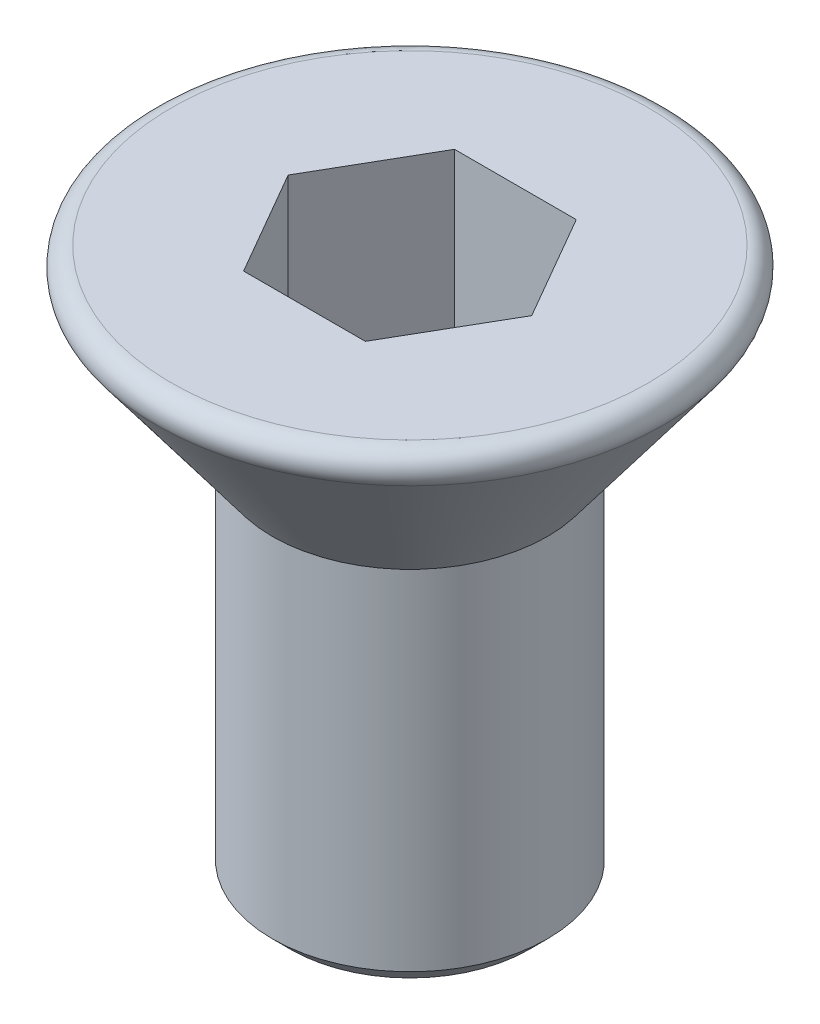
ISO-10303-21;
HEADER;
FILE_DESCRIPTION(('STEP AP214'),'2;1');
FILE_NAME('part.step','',(''),(''),'','','');
FILE_SCHEMA(('AUTOMOTIVE_DESIGN { 1 0 10303 214 1 1 1 1 }'));
ENDSEC;
DATA;
#1=APPLICATION_CONTEXT('core data for automotive mechanical design processes');
#2=APPLICATION_PROTOCOL_DEFINITION('international standard','automotive_design',2000,#1);
#3=PRODUCT_CONTEXT('',#1,'mechanical');
#4=PRODUCT('Part','Part','',(#3));
#5=PRODUCT_RELATED_PRODUCT_CATEGORY('part','',(#4));
#6=PRODUCT_DEFINITION_FORMATION('','',#4);
#7=PRODUCT_DEFINITION_CONTEXT('part definition',#1,'design');
#8=PRODUCT_DEFINITION('design','',#6,#7);
#9=PRODUCT_DEFINITION_SHAPE('','',#8);
#10=(LENGTH_UNIT() NAMED_UNIT(*) SI_UNIT(.MILLI.,.METRE.));
#11=(NAMED_UNIT(*) PLANE_ANGLE_UNIT() SI_UNIT($,.RADIAN.));
#12=(NAMED_UNIT(*) SI_UNIT($,.STERADIAN.) SOLID_ANGLE_UNIT());
#13=UNCERTAINTY_MEASURE_WITH_UNIT(LENGTH_MEASURE(1.E-05),#10,'distance_accuracy_value','');
#14=(GEOMETRIC_REPRESENTATION_CONTEXT(3) GLOBAL_UNCERTAINTY_ASSIGNED_CONTEXT((#13)) GLOBAL_UNIT_ASSIGNED_CONTEXT((#10,
#11,#12)) REPRESENTATION_CONTEXT('',''));
#15=CARTESIAN_POINT('',(0.,0.,0.));
#16=DIRECTION('',(0.,0.,1.));
#17=DIRECTION('',(1.,0.,0.));
#18=AXIS2_PLACEMENT_3D('',#15,#16,#17);
#19=CARTESIAN_POINT('',(3.,0.,0.));
#20=DIRECTION('',(0.,-1.,0.));
#21=DIRECTION('',(1.,0.,0.));
#22=AXIS2_PLACEMENT_3D('',#19,#20,#21);
#23=PLANE('',#22);
#24=CARTESIAN_POINT('',(0.,0.,0.));
#25=DIRECTION('',(0.,-1.,0.));
#26=DIRECTION('',(1.,0.,0.));
#27=AXIS2_PLACEMENT_3D('',#24,#25,#26);
#28=CIRCLE('',#27,2.6);
#29=CARTESIAN_POINT('',(2.6,0.,0.));
#30=VERTEX_POINT('',#29);
#31=EDGE_CURVE('E43',#30,#30,#28,.F.);
#32=ORIENTED_EDGE('',*,*,#31,.T.);
#33=EDGE_LOOP('',(#32));
#34=FACE_BOUND('',#33,.T.);
#35=DIRECTION('',(0.5,0.,0.866025403784439));
#36=VECTOR('',#35,1.);
#37=CARTESIAN_POINT('',(-1.32790561913614,0.,0.));
#38=LINE('',#37,#36);
#39=CARTESIAN_POINT('',(-1.32790561913614,0.,0.));
#40=VERTEX_POINT('',#39);
#41=CARTESIAN_POINT('',(-0.66395280956807,0.,1.15));
#42=VERTEX_POINT('',#41);
#43=EDGE_CURVE('E124',#40,#42,#38,.T.);
#44=ORIENTED_EDGE('',*,*,#43,.F.);
#45=DIRECTION('',(-0.5,0.,0.866025403784438));
#46=VECTOR('',#45,1.);
#47=CARTESIAN_POINT('',(-0.66395280956807,0.,-1.15));
#48=LINE('',#47,#46);
#49=CARTESIAN_POINT('',(-0.66395280956807,0.,-1.15));
#50=VERTEX_POINT('',#49);
#51=EDGE_CURVE('E50',#50,#40,#48,.T.);
#52=ORIENTED_EDGE('',*,*,#51,.F.);
#53=DIRECTION('',(-1.,0.,0.));
#54=VECTOR('',#53,1.);
#55=CARTESIAN_POINT('',(0.66395280956807,0.,-1.15));
#56=LINE('',#55,#54);
#57=CARTESIAN_POINT('',(0.66395280956807,0.,-1.15));
#58=VERTEX_POINT('',#57);
#59=EDGE_CURVE('E133',#58,#50,#56,.T.);
#60=ORIENTED_EDGE('',*,*,#59,.F.);
#61=DIRECTION('',(-0.5,0.,-0.866025403784439));
#62=VECTOR('',#61,1.);
#63=CARTESIAN_POINT('',(1.32790561913614,0.,0.));
#64=LINE('',#63,#62);
#65=CARTESIAN_POINT('',(1.32790561913614,0.,0.));
#66=VERTEX_POINT('',#65);
#67=EDGE_CURVE('E131',#66,#58,#64,.T.);
#68=ORIENTED_EDGE('',*,*,#67,.F.);
#69=DIRECTION('',(0.5,0.,-0.866025403784439));
#70=VECTOR('',#69,1.);
#71=CARTESIAN_POINT('',(0.66395280956807,0.,1.15));
#72=LINE('',#71,#70);
#73=CARTESIAN_POINT('',(0.66395280956807,0.,1.15));
#74=VERTEX_POINT('',#73);
#75=EDGE_CURVE('E98',#74,#66,#72,.T.);
#76=ORIENTED_EDGE('',*,*,#75,.F.);
#77=DIRECTION('',(1.,0.,0.));
#78=VECTOR('',#77,1.);
#79=CARTESIAN_POINT('',(-0.66395280956807,0.,1.15));
#80=LINE('',#79,#78);
#81=EDGE_CURVE('E127',#42,#74,#80,.T.);
#82=ORIENTED_EDGE('',*,*,#81,.F.);
#83=EDGE_LOOP('',(#44,#52,#60,#68,#76,#82));
#84=FACE_BOUND('',#83,.T.);
#85=ADVANCED_FACE('F35',(#34,#84),#23,.F.);
#86=CARTESIAN_POINT('',(0.,-2.,0.));
#87=DIRECTION('',(0.,1.,0.));
#88=DIRECTION('',(-1.,0.,0.));
#89=AXIS2_PLACEMENT_3D('',#86,#87,#88);
#90=CONICAL_SURFACE('',#89,1.5,0.643501108793284);
#91=CARTESIAN_POINT('',(0.,-0.32,0.));
#92=DIRECTION('',(0.,-1.,0.));
#93=DIRECTION('',(1.,0.,0.));
#94=AXIS2_PLACEMENT_3D('',#91,#92,#93);
#95=CIRCLE('',#94,2.76);
#96=CARTESIAN_POINT('',(2.76,-0.32,0.));
#97=VERTEX_POINT('',#96);
#98=EDGE_CURVE('E11',#97,#97,#95,.T.);
#99=ORIENTED_EDGE('',*,*,#98,.T.);
#100=EDGE_LOOP('',(#99));
#101=FACE_BOUND('',#100,.T.);
#102=CARTESIAN_POINT('',(0.,-2.,0.));
#103=DIRECTION('',(0.,-1.,0.));
#104=DIRECTION('',(1.,0.,0.));
#105=AXIS2_PLACEMENT_3D('',#102,#103,#104);
#106=CIRCLE('',#105,1.5);
#107=CARTESIAN_POINT('',(1.5,-2.,0.));
#108=VERTEX_POINT('',#107);
#109=EDGE_CURVE('E137',#108,#108,#106,.T.);
#110=ORIENTED_EDGE('',*,*,#109,.F.);
#111=EDGE_LOOP('',(#110));
#112=FACE_BOUND('',#111,.T.);
#113=ADVANCED_FACE('F164',(#101,#112),#90,.T.);
#114=CARTESIAN_POINT('',(0.,-6.,0.));
#115=DIRECTION('',(0.,1.,0.));
#116=DIRECTION('',(-1.,0.,0.));
#117=AXIS2_PLACEMENT_3D('',#114,#115,#116);
#118=CYLINDRICAL_SURFACE('',#117,1.5);
#119=CARTESIAN_POINT('',(0.,-5.8,0.));
#120=DIRECTION('',(0.,-1.,0.));
#121=DIRECTION('',(1.,0.,0.));
#122=AXIS2_PLACEMENT_3D('',#119,#120,#121);
#123=CIRCLE('',#122,1.5);
#124=CARTESIAN_POINT('',(1.5,-5.8,0.));
#125=VERTEX_POINT('',#124);
#126=EDGE_CURVE('E148',#125,#125,#123,.F.);
#127=ORIENTED_EDGE('',*,*,#126,.T.);
#128=EDGE_LOOP('',(#127));
#129=FACE_BOUND('',#128,.T.);
#130=ORIENTED_EDGE('',*,*,#109,.T.);
#131=EDGE_LOOP('',(#130));
#132=FACE_BOUND('',#131,.T.);
#133=ADVANCED_FACE('F169',(#129,#132),#118,.T.);
#134=CARTESIAN_POINT('',(0.,-6.,0.));
#135=DIRECTION('',(0.,-1.,0.));
#136=DIRECTION('',(1.,0.,0.));
#137=AXIS2_PLACEMENT_3D('',#134,#135,#136);
#138=PLANE('',#137);
#139=CARTESIAN_POINT('',(0.,-6.,0.));
#140=DIRECTION('',(0.,-1.,0.));
#141=DIRECTION('',(1.,0.,0.));
#142=AXIS2_PLACEMENT_3D('',#139,#140,#141);
#143=CIRCLE('',#142,1.3);
#144=CARTESIAN_POINT('',(1.3,-6.,0.));
#145=VERTEX_POINT('',#144);
#146=EDGE_CURVE('E145',#145,#145,#143,.T.);
#147=ORIENTED_EDGE('',*,*,#146,.T.);
#148=EDGE_LOOP('',(#147));
#149=FACE_BOUND('',#148,.T.);
#150=ADVANCED_FACE('F175',(#149),#138,.T.);
#151=CARTESIAN_POINT('',(-0.663952809568069,-2.,-1.15));
#152=DIRECTION('',(-0.866025403784439,0.,-0.5));
#153=DIRECTION('',(-0.5,0.,0.866025403784438));
#154=AXIS2_PLACEMENT_3D('',#151,#152,#153);
#155=PLANE('',#154);
#156=ORIENTED_EDGE('',*,*,#51,.T.);
#157=DIRECTION('',(0.,1.,0.));
#158=VECTOR('',#157,1.);
#159=CARTESIAN_POINT('',(-1.32790561913614,-2.,0.));
#160=LINE('',#159,#158);
#161=CARTESIAN_POINT('',(-1.32790561913614,-2.,0.));
#162=VERTEX_POINT('',#161);
#163=EDGE_CURVE('E80',#162,#40,#160,.T.);
#164=ORIENTED_EDGE('',*,*,#163,.F.);
#165=DIRECTION('',(-0.5,0.,0.866025403784438));
#166=VECTOR('',#165,1.);
#167=CARTESIAN_POINT('',(-0.663952809568069,-2.,-1.15));
#168=LINE('',#167,#166);
#169=CARTESIAN_POINT('',(-0.663952809568069,-2.,-1.15));
#170=VERTEX_POINT('',#169);
#171=EDGE_CURVE('E135',#170,#162,#168,.T.);
#172=ORIENTED_EDGE('',*,*,#171,.F.);
#173=DIRECTION('',(0.,1.,0.));
#174=VECTOR('',#173,1.);
#175=CARTESIAN_POINT('',(-0.663952809568069,-2.,-1.15));
#176=LINE('',#175,#174);
#177=EDGE_CURVE('E58',#170,#50,#176,.T.);
#178=ORIENTED_EDGE('',*,*,#177,.T.);
#179=EDGE_LOOP('',(#156,#164,#172,#178));
#180=FACE_BOUND('',#179,.T.);
#181=ADVANCED_FACE('F179',(#180),#155,.F.);
#182=CARTESIAN_POINT('',(0.66395280956807,-2.,-1.15));
#183=DIRECTION('',(0.,0.,-1.));
#184=DIRECTION('',(-1.,0.,0.));
#185=AXIS2_PLACEMENT_3D('',#182,#183,#184);
#186=PLANE('',#185);
#187=ORIENTED_EDGE('',*,*,#59,.T.);
#188=ORIENTED_EDGE('',*,*,#177,.F.);
#189=DIRECTION('',(-1.,0.,0.));
#190=VECTOR('',#189,1.);
#191=CARTESIAN_POINT('',(0.66395280956807,-2.,-1.15));
#192=LINE('',#191,#190);
#193=CARTESIAN_POINT('',(0.66395280956807,-2.,-1.15));
#194=VERTEX_POINT('',#193);
#195=EDGE_CURVE('E110',#194,#170,#192,.T.);
#196=ORIENTED_EDGE('',*,*,#195,.F.);
#197=DIRECTION('',(0.,1.,0.));
#198=VECTOR('',#197,1.);
#199=CARTESIAN_POINT('',(0.66395280956807,-2.,-1.15));
#200=LINE('',#199,#198);
#201=EDGE_CURVE('E102',#194,#58,#200,.T.);
#202=ORIENTED_EDGE('',*,*,#201,.T.);
#203=EDGE_LOOP('',(#187,#188,#196,#202));
#204=FACE_BOUND('',#203,.T.);
#205=ADVANCED_FACE('F183',(#204),#186,.F.);
#206=CARTESIAN_POINT('',(1.32790561913614,-2.,0.));
#207=DIRECTION('',(0.866025403784439,0.,-0.5));
#208=DIRECTION('',(-0.5,0.,-0.866025403784439));
#209=AXIS2_PLACEMENT_3D('',#206,#207,#208);
#210=PLANE('',#209);
#211=ORIENTED_EDGE('',*,*,#67,.T.);
#212=ORIENTED_EDGE('',*,*,#201,.F.);
#213=DIRECTION('',(-0.5,0.,-0.866025403784439));
#214=VECTOR('',#213,1.);
#215=CARTESIAN_POINT('',(1.32790561913614,-2.,0.));
#216=LINE('',#215,#214);
#217=CARTESIAN_POINT('',(1.32790561913614,-2.,0.));
#218=VERTEX_POINT('',#217);
#219=EDGE_CURVE('E106',#218,#194,#216,.T.);
#220=ORIENTED_EDGE('',*,*,#219,.F.);
#221=DIRECTION('',(0.,1.,0.));
#222=VECTOR('',#221,1.);
#223=CARTESIAN_POINT('',(1.32790561913614,-2.,0.));
#224=LINE('',#223,#222);
#225=EDGE_CURVE('E91',#218,#66,#224,.T.);
#226=ORIENTED_EDGE('',*,*,#225,.T.);
#227=EDGE_LOOP('',(#211,#212,#220,#226));
#228=FACE_BOUND('',#227,.T.);
#229=ADVANCED_FACE('F107',(#228),#210,.F.);
#230=CARTESIAN_POINT('',(0.66395280956807,-2.,1.15));
#231=DIRECTION('',(0.866025403784439,0.,0.5));
#232=DIRECTION('',(0.5,0.,-0.866025403784439));
#233=AXIS2_PLACEMENT_3D('',#230,#231,#232);
#234=PLANE('',#233);
#235=ORIENTED_EDGE('',*,*,#75,.T.);
#236=ORIENTED_EDGE('',*,*,#225,.F.);
#237=DIRECTION('',(0.5,0.,-0.866025403784439));
#238=VECTOR('',#237,1.);
#239=CARTESIAN_POINT('',(0.66395280956807,-2.,1.15));
#240=LINE('',#239,#238);
#241=CARTESIAN_POINT('',(0.66395280956807,-2.,1.15));
#242=VERTEX_POINT('',#241);
#243=EDGE_CURVE('E95',#242,#218,#240,.T.);
#244=ORIENTED_EDGE('',*,*,#243,.F.);
#245=DIRECTION('',(0.,1.,0.));
#246=VECTOR('',#245,1.);
#247=CARTESIAN_POINT('',(0.66395280956807,-2.,1.15));
#248=LINE('',#247,#246);
#249=EDGE_CURVE('E103',#242,#74,#248,.T.);
#250=ORIENTED_EDGE('',*,*,#249,.T.);
#251=EDGE_LOOP('',(#235,#236,#244,#250));
#252=FACE_BOUND('',#251,.T.);
#253=ADVANCED_FACE('F93',(#252),#234,.F.);
#254=CARTESIAN_POINT('',(-0.66395280956807,-2.,1.15));
#255=DIRECTION('',(0.,0.,1.));
#256=DIRECTION('',(1.,0.,0.));
#257=AXIS2_PLACEMENT_3D('',#254,#255,#256);
#258=PLANE('',#257);
#259=ORIENTED_EDGE('',*,*,#81,.T.);
#260=ORIENTED_EDGE('',*,*,#249,.F.);
#261=DIRECTION('',(1.,0.,0.));
#262=VECTOR('',#261,1.);
#263=CARTESIAN_POINT('',(-0.66395280956807,-2.,1.15));
#264=LINE('',#263,#262);
#265=CARTESIAN_POINT('',(-0.66395280956807,-2.,1.15));
#266=VERTEX_POINT('',#265);
#267=EDGE_CURVE('E116',#266,#242,#264,.T.);
#268=ORIENTED_EDGE('',*,*,#267,.F.);
#269=DIRECTION('',(0.,1.,0.));
#270=VECTOR('',#269,1.);
#271=CARTESIAN_POINT('',(-0.66395280956807,-2.,1.15));
#272=LINE('',#271,#270);
#273=EDGE_CURVE('E140',#266,#42,#272,.T.);
#274=ORIENTED_EDGE('',*,*,#273,.T.);
#275=EDGE_LOOP('',(#259,#260,#268,#274));
#276=FACE_BOUND('',#275,.T.);
#277=ADVANCED_FACE('F187',(#276),#258,.F.);
#278=CARTESIAN_POINT('',(-1.32790561913614,-2.,0.));
#279=DIRECTION('',(-0.866025403784439,0.,0.5));
#280=DIRECTION('',(0.5,0.,0.866025403784439));
#281=AXIS2_PLACEMENT_3D('',#278,#279,#280);
#282=PLANE('',#281);
#283=ORIENTED_EDGE('',*,*,#43,.T.);
#284=ORIENTED_EDGE('',*,*,#273,.F.);
#285=DIRECTION('',(0.5,0.,0.866025403784439));
#286=VECTOR('',#285,1.);
#287=CARTESIAN_POINT('',(-1.32790561913614,-2.,0.));
#288=LINE('',#287,#286);
#289=EDGE_CURVE('E118',#162,#266,#288,.T.);
#290=ORIENTED_EDGE('',*,*,#289,.F.);
#291=ORIENTED_EDGE('',*,*,#163,.T.);
#292=EDGE_LOOP('',(#283,#284,#290,#291));
#293=FACE_BOUND('',#292,.T.);
#294=ADVANCED_FACE('F184',(#293),#282,.F.);
#295=CARTESIAN_POINT('',(0.,-2.,0.));
#296=DIRECTION('',(0.,1.,0.));
#297=DIRECTION('',(-1.,0.,0.));
#298=AXIS2_PLACEMENT_3D('',#295,#296,#297);
#299=PLANE('',#298);
#300=ORIENTED_EDGE('',*,*,#171,.T.);
#301=ORIENTED_EDGE('',*,*,#289,.T.);
#302=ORIENTED_EDGE('',*,*,#267,.T.);
#303=ORIENTED_EDGE('',*,*,#243,.T.);
#304=ORIENTED_EDGE('',*,*,#219,.T.);
#305=ORIENTED_EDGE('',*,*,#195,.T.);
#306=EDGE_LOOP('',(#300,#301,#302,#303,#304,#305));
#307=FACE_BOUND('',#306,.T.);
#308=ADVANCED_FACE('F113',(#307),#299,.T.);
#309=CARTESIAN_POINT('',(0.,-6.,0.));
#310=DIRECTION('',(0.,1.,0.));
#311=DIRECTION('',(-1.,0.,0.));
#312=AXIS2_PLACEMENT_3D('',#309,#310,#311);
#313=CONICAL_SURFACE('',#312,1.3,0.785398163397447);
#314=ORIENTED_EDGE('',*,*,#126,.F.);
#315=EDGE_LOOP('',(#314));
#316=FACE_BOUND('',#315,.T.);
#317=ORIENTED_EDGE('',*,*,#146,.F.);
#318=EDGE_LOOP('',(#317));
#319=FACE_BOUND('',#318,.T.);
#320=ADVANCED_FACE('F156',(#316,#319),#313,.T.);
#321=CARTESIAN_POINT('',(0.,-0.2,0.));
#322=DIRECTION('',(0.,-1.,0.));
#323=DIRECTION('',(1.,0.,0.));
#324=AXIS2_PLACEMENT_3D('',#321,#322,#323);
#325=TOROIDAL_SURFACE('',#324,2.6,0.2);
#326=ORIENTED_EDGE('',*,*,#98,.F.);
#327=EDGE_LOOP('',(#326));
#328=FACE_BOUND('',#327,.T.);
#329=ORIENTED_EDGE('',*,*,#31,.F.);
#330=EDGE_LOOP('',(#329));
#331=FACE_BOUND('',#330,.T.);
#332=ADVANCED_FACE('F37',(#328,#331),#325,.T.);
#333=CLOSED_SHELL('',(#85,#113,#133,#150,#181,#205,#229,#253,#277,#294,#308,#320,#332));
#334=MANIFOLD_SOLID_BREP('B2',#333);
#335=ADVANCED_BREP_SHAPE_REPRESENTATION('',(#18,#334),#14);
#336=SHAPE_DEFINITION_REPRESENTATION(#9,#335);
ENDSEC;
END-ISO-10303-21;
